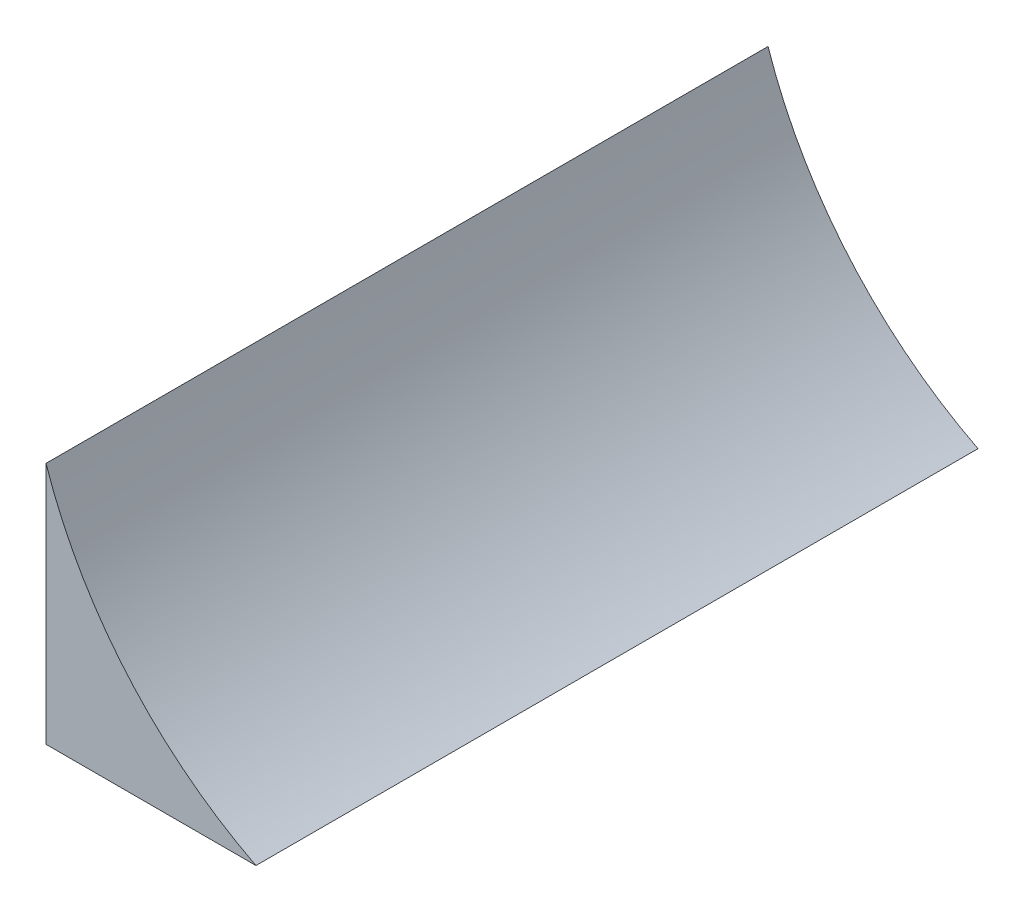
ISO-10303-21;
HEADER;
FILE_DESCRIPTION(('STEP AP214'),'2;1');
FILE_NAME('part.step','',(''),(''),'','','');
FILE_SCHEMA(('AUTOMOTIVE_DESIGN { 1 0 10303 214 1 1 1 1 }'));
ENDSEC;
DATA;
#1=APPLICATION_CONTEXT('core data for automotive mechanical design processes');
#2=APPLICATION_PROTOCOL_DEFINITION('international standard','automotive_design',2000,#1);
#3=PRODUCT_CONTEXT('',#1,'mechanical');
#4=PRODUCT('Part','Part','',(#3));
#5=PRODUCT_RELATED_PRODUCT_CATEGORY('part','',(#4));
#6=PRODUCT_DEFINITION_FORMATION('','',#4);
#7=PRODUCT_DEFINITION_CONTEXT('part definition',#1,'design');
#8=PRODUCT_DEFINITION('design','',#6,#7);
#9=PRODUCT_DEFINITION_SHAPE('','',#8);
#10=(LENGTH_UNIT() NAMED_UNIT(*) SI_UNIT(.MILLI.,.METRE.));
#11=(NAMED_UNIT(*) PLANE_ANGLE_UNIT() SI_UNIT($,.RADIAN.));
#12=(NAMED_UNIT(*) SI_UNIT($,.STERADIAN.) SOLID_ANGLE_UNIT());
#13=UNCERTAINTY_MEASURE_WITH_UNIT(LENGTH_MEASURE(1.E-05),#10,'distance_accuracy_value','');
#14=(GEOMETRIC_REPRESENTATION_CONTEXT(3) GLOBAL_UNCERTAINTY_ASSIGNED_CONTEXT((#13)) GLOBAL_UNIT_ASSIGNED_CONTEXT((#10,
#11,#12)) REPRESENTATION_CONTEXT('',''));
#15=CARTESIAN_POINT('',(0.,0.,0.));
#16=DIRECTION('',(0.,0.,1.));
#17=DIRECTION('',(1.,0.,0.));
#18=AXIS2_PLACEMENT_3D('',#15,#16,#17);
#19=CARTESIAN_POINT('',(0.,0.,254.));
#20=DIRECTION('',(0.,1.,0.));
#21=DIRECTION('',(0.,0.,1.));
#22=AXIS2_PLACEMENT_3D('',#19,#20,#21);
#23=PLANE('',#22);
#24=DIRECTION('',(1.,0.,0.));
#25=VECTOR('',#24,1.);
#26=CARTESIAN_POINT('',(0.,0.,0.));
#27=LINE('',#26,#25);
#28=CARTESIAN_POINT('',(0.,0.,0.));
#29=VERTEX_POINT('',#28);
#30=CARTESIAN_POINT('',(73.8563943524448,0.,0.));
#31=VERTEX_POINT('',#30);
#32=EDGE_CURVE('E80',#29,#31,#27,.T.);
#33=ORIENTED_EDGE('',*,*,#32,.T.);
#34=DIRECTION('',(0.,0.,-1.));
#35=VECTOR('',#34,1.);
#36=CARTESIAN_POINT('',(73.8563943524448,0.,254.));
#37=LINE('',#36,#35);
#38=CARTESIAN_POINT('',(73.8563943524448,0.,254.));
#39=VERTEX_POINT('',#38);
#40=EDGE_CURVE('E11',#39,#31,#37,.T.);
#41=ORIENTED_EDGE('',*,*,#40,.F.);
#42=DIRECTION('',(1.,0.,0.));
#43=VECTOR('',#42,1.);
#44=CARTESIAN_POINT('',(0.,0.,254.));
#45=LINE('',#44,#43);
#46=CARTESIAN_POINT('',(0.,0.,254.));
#47=VERTEX_POINT('',#46);
#48=EDGE_CURVE('E73',#47,#39,#45,.T.);
#49=ORIENTED_EDGE('',*,*,#48,.F.);
#50=DIRECTION('',(0.,0.,-1.));
#51=VECTOR('',#50,1.);
#52=CARTESIAN_POINT('',(0.,0.,254.));
#53=LINE('',#52,#51);
#54=EDGE_CURVE('E81',#47,#29,#53,.T.);
#55=ORIENTED_EDGE('',*,*,#54,.T.);
#56=EDGE_LOOP('',(#33,#41,#49,#55));
#57=FACE_BOUND('',#56,.T.);
#58=ADVANCED_FACE('F33',(#57),#23,.F.);
#59=CARTESIAN_POINT('',(141.960164116351,133.418952251089,254.));
#60=DIRECTION('',(0.,0.,-1.));
#61=DIRECTION('',(-1.,0.,0.));
#62=AXIS2_PLACEMENT_3D('',#59,#60,#61);
#63=CYLINDRICAL_SURFACE('',#62,149.795661739028);
#64=CARTESIAN_POINT('',(141.960164116351,133.418952251089,0.));
#65=DIRECTION('',(0.,0.,-1.));
#66=DIRECTION('',(-1.,0.,0.));
#67=AXIS2_PLACEMENT_3D('',#64,#65,#66);
#68=CIRCLE('',#67,149.795661739028);
#69=CARTESIAN_POINT('',(0.,85.6062752721519,0.));
#70=VERTEX_POINT('',#69);
#71=EDGE_CURVE('E61',#31,#70,#68,.T.);
#72=ORIENTED_EDGE('',*,*,#71,.T.);
#73=DIRECTION('',(0.,0.,-1.));
#74=VECTOR('',#73,1.);
#75=CARTESIAN_POINT('',(0.,85.6062752721519,254.));
#76=LINE('',#75,#74);
#77=CARTESIAN_POINT('',(0.,85.6062752721519,254.));
#78=VERTEX_POINT('',#77);
#79=EDGE_CURVE('E41',#78,#70,#76,.T.);
#80=ORIENTED_EDGE('',*,*,#79,.F.);
#81=CARTESIAN_POINT('',(141.960164116351,133.418952251089,254.));
#82=DIRECTION('',(0.,0.,-1.));
#83=DIRECTION('',(-1.,0.,0.));
#84=AXIS2_PLACEMENT_3D('',#81,#82,#83);
#85=CIRCLE('',#84,149.795661739028);
#86=EDGE_CURVE('E69',#39,#78,#85,.T.);
#87=ORIENTED_EDGE('',*,*,#86,.F.);
#88=ORIENTED_EDGE('',*,*,#40,.T.);
#89=EDGE_LOOP('',(#72,#80,#87,#88));
#90=FACE_BOUND('',#89,.T.);
#91=ADVANCED_FACE('F70',(#90),#63,.F.);
#92=CARTESIAN_POINT('',(0.,0.,254.));
#93=DIRECTION('',(1.,0.,0.));
#94=DIRECTION('',(0.,0.,-1.));
#95=AXIS2_PLACEMENT_3D('',#92,#93,#94);
#96=PLANE('',#95);
#97=DIRECTION('',(0.,-1.,0.));
#98=VECTOR('',#97,1.);
#99=CARTESIAN_POINT('',(0.,0.,0.));
#100=LINE('',#99,#98);
#101=EDGE_CURVE('E66',#70,#29,#100,.T.);
#102=ORIENTED_EDGE('',*,*,#101,.T.);
#103=ORIENTED_EDGE('',*,*,#54,.F.);
#104=DIRECTION('',(0.,-1.,0.));
#105=VECTOR('',#104,1.);
#106=CARTESIAN_POINT('',(0.,0.,254.));
#107=LINE('',#106,#105);
#108=EDGE_CURVE('E49',#78,#47,#107,.T.);
#109=ORIENTED_EDGE('',*,*,#108,.F.);
#110=ORIENTED_EDGE('',*,*,#79,.T.);
#111=EDGE_LOOP('',(#102,#103,#109,#110));
#112=FACE_BOUND('',#111,.T.);
#113=ADVANCED_FACE('F88',(#112),#96,.F.);
#114=CARTESIAN_POINT('',(141.960164116351,133.418952251089,254.));
#115=DIRECTION('',(0.,0.,-1.));
#116=DIRECTION('',(-1.,0.,0.));
#117=AXIS2_PLACEMENT_3D('',#114,#115,#116);
#118=PLANE('',#117);
#119=ORIENTED_EDGE('',*,*,#48,.T.);
#120=ORIENTED_EDGE('',*,*,#86,.T.);
#121=ORIENTED_EDGE('',*,*,#108,.T.);
#122=EDGE_LOOP('',(#119,#120,#121));
#123=FACE_BOUND('',#122,.T.);
#124=ADVANCED_FACE('F76',(#123),#118,.F.);
#125=CARTESIAN_POINT('',(141.960164116351,133.418952251089,0.));
#126=DIRECTION('',(0.,0.,-1.));
#127=DIRECTION('',(-1.,0.,0.));
#128=AXIS2_PLACEMENT_3D('',#125,#126,#127);
#129=PLANE('',#128);
#130=ORIENTED_EDGE('',*,*,#32,.F.);
#131=ORIENTED_EDGE('',*,*,#101,.F.);
#132=ORIENTED_EDGE('',*,*,#71,.F.);
#133=EDGE_LOOP('',(#130,#131,#132));
#134=FACE_BOUND('',#133,.T.);
#135=ADVANCED_FACE('F89',(#134),#129,.T.);
#136=CLOSED_SHELL('',(#58,#91,#113,#124,#135));
#137=MANIFOLD_SOLID_BREP('B2',#136);
#138=ADVANCED_BREP_SHAPE_REPRESENTATION('',(#18,#137),#14);
#139=SHAPE_DEFINITION_REPRESENTATION(#9,#138);
ENDSEC;
END-ISO-10303-21;
